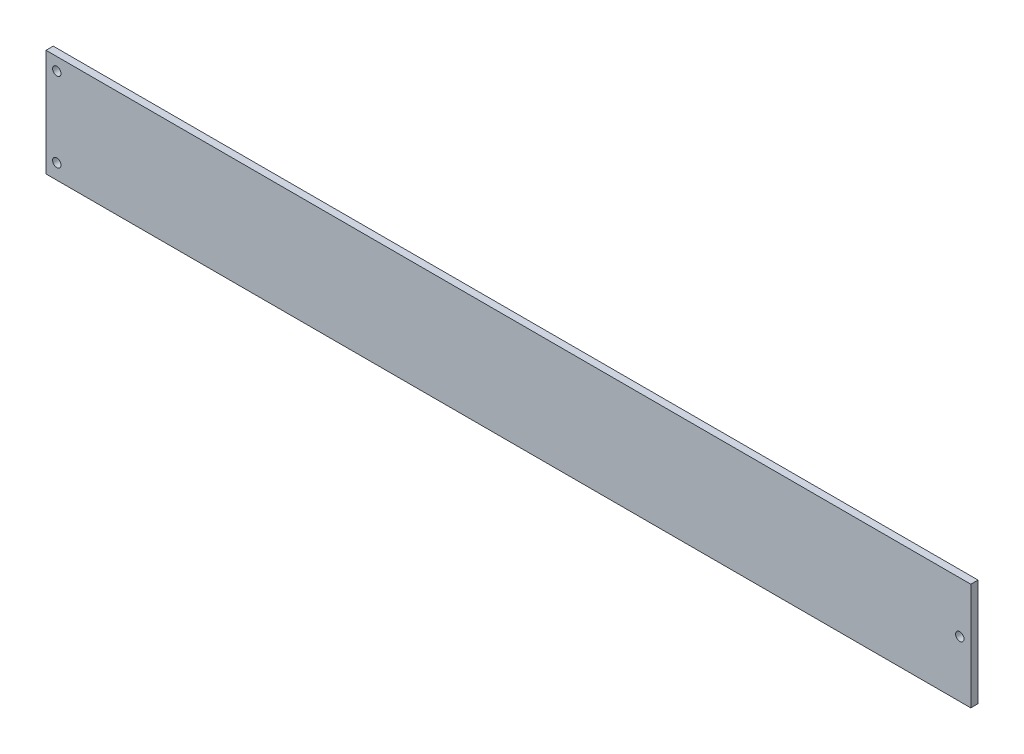
ISO-10303-21;
HEADER;
FILE_DESCRIPTION(('STEP AP214'),'2;1');
FILE_NAME('part.step','',(''),(''),'','','');
FILE_SCHEMA(('AUTOMOTIVE_DESIGN { 1 0 10303 214 1 1 1 1 }'));
ENDSEC;
DATA;
#1=APPLICATION_CONTEXT('core data for automotive mechanical design processes');
#2=APPLICATION_PROTOCOL_DEFINITION('international standard','automotive_design',2000,#1);
#3=PRODUCT_CONTEXT('',#1,'mechanical');
#4=PRODUCT('Part','Part','',(#3));
#5=PRODUCT_RELATED_PRODUCT_CATEGORY('part','',(#4));
#6=PRODUCT_DEFINITION_FORMATION('','',#4);
#7=PRODUCT_DEFINITION_CONTEXT('part definition',#1,'design');
#8=PRODUCT_DEFINITION('design','',#6,#7);
#9=PRODUCT_DEFINITION_SHAPE('','',#8);
#10=(LENGTH_UNIT() NAMED_UNIT(*) SI_UNIT(.MILLI.,.METRE.));
#11=(NAMED_UNIT(*) PLANE_ANGLE_UNIT() SI_UNIT($,.RADIAN.));
#12=(NAMED_UNIT(*) SI_UNIT($,.STERADIAN.) SOLID_ANGLE_UNIT());
#13=UNCERTAINTY_MEASURE_WITH_UNIT(LENGTH_MEASURE(1.E-05),#10,'distance_accuracy_value','');
#14=(GEOMETRIC_REPRESENTATION_CONTEXT(3) GLOBAL_UNCERTAINTY_ASSIGNED_CONTEXT((#13)) GLOBAL_UNIT_ASSIGNED_CONTEXT((#10,
#11,#12)) REPRESENTATION_CONTEXT('',''));
#15=CARTESIAN_POINT('',(0.,0.,0.));
#16=DIRECTION('',(0.,0.,1.));
#17=DIRECTION('',(1.,0.,0.));
#18=AXIS2_PLACEMENT_3D('',#15,#16,#17);
#19=CARTESIAN_POINT('',(192.5,-22.3,3.));
#20=DIRECTION('',(-1.,0.,0.));
#21=DIRECTION('',(0.,0.,1.));
#22=AXIS2_PLACEMENT_3D('',#19,#20,#21);
#23=PLANE('',#22);
#24=DIRECTION('',(0.,1.,0.));
#25=VECTOR('',#24,1.);
#26=CARTESIAN_POINT('',(192.5,-22.3,0.));
#27=LINE('',#26,#25);
#28=CARTESIAN_POINT('',(192.5,-22.3,0.));
#29=VERTEX_POINT('',#28);
#30=CARTESIAN_POINT('',(192.5,22.3,0.));
#31=VERTEX_POINT('',#30);
#32=EDGE_CURVE('E108',#29,#31,#27,.T.);
#33=ORIENTED_EDGE('',*,*,#32,.T.);
#34=DIRECTION('',(0.,0.,-1.));
#35=VECTOR('',#34,1.);
#36=CARTESIAN_POINT('',(192.5,22.3,3.));
#37=LINE('',#36,#35);
#38=CARTESIAN_POINT('',(192.5,22.3,3.));
#39=VERTEX_POINT('',#38);
#40=EDGE_CURVE('E11',#39,#31,#37,.T.);
#41=ORIENTED_EDGE('',*,*,#40,.F.);
#42=DIRECTION('',(0.,1.,0.));
#43=VECTOR('',#42,1.);
#44=CARTESIAN_POINT('',(192.5,-22.3,3.));
#45=LINE('',#44,#43);
#46=CARTESIAN_POINT('',(192.5,-22.3,3.));
#47=VERTEX_POINT('',#46);
#48=EDGE_CURVE('E93',#47,#39,#45,.T.);
#49=ORIENTED_EDGE('',*,*,#48,.F.);
#50=DIRECTION('',(0.,0.,-1.));
#51=VECTOR('',#50,1.);
#52=CARTESIAN_POINT('',(192.5,-22.3,3.));
#53=LINE('',#52,#51);
#54=EDGE_CURVE('E104',#47,#29,#53,.T.);
#55=ORIENTED_EDGE('',*,*,#54,.T.);
#56=EDGE_LOOP('',(#33,#41,#49,#55));
#57=FACE_BOUND('',#56,.T.);
#58=ADVANCED_FACE('F39',(#57),#23,.F.);
#59=CARTESIAN_POINT('',(-192.5,22.3,3.));
#60=DIRECTION('',(0.,-1.,0.));
#61=DIRECTION('',(0.,0.,-1.));
#62=AXIS2_PLACEMENT_3D('',#59,#60,#61);
#63=PLANE('',#62);
#64=DIRECTION('',(-1.,0.,0.));
#65=VECTOR('',#64,1.);
#66=CARTESIAN_POINT('',(-192.5,22.3,0.));
#67=LINE('',#66,#65);
#68=CARTESIAN_POINT('',(-192.5,22.3,0.));
#69=VERTEX_POINT('',#68);
#70=EDGE_CURVE('E98',#31,#69,#67,.T.);
#71=ORIENTED_EDGE('',*,*,#70,.T.);
#72=DIRECTION('',(0.,0.,-1.));
#73=VECTOR('',#72,1.);
#74=CARTESIAN_POINT('',(-192.5,22.3,3.));
#75=LINE('',#74,#73);
#76=CARTESIAN_POINT('',(-192.5,22.3,3.));
#77=VERTEX_POINT('',#76);
#78=EDGE_CURVE('E48',#77,#69,#75,.T.);
#79=ORIENTED_EDGE('',*,*,#78,.F.);
#80=DIRECTION('',(-1.,0.,0.));
#81=VECTOR('',#80,1.);
#82=CARTESIAN_POINT('',(-192.5,22.3,3.));
#83=LINE('',#82,#81);
#84=EDGE_CURVE('E88',#39,#77,#83,.T.);
#85=ORIENTED_EDGE('',*,*,#84,.F.);
#86=ORIENTED_EDGE('',*,*,#40,.T.);
#87=EDGE_LOOP('',(#71,#79,#85,#86));
#88=FACE_BOUND('',#87,.T.);
#89=ADVANCED_FACE('F97',(#88),#63,.F.);
#90=CARTESIAN_POINT('',(-192.5,-22.3,3.));
#91=DIRECTION('',(1.,0.,0.));
#92=DIRECTION('',(0.,0.,-1.));
#93=AXIS2_PLACEMENT_3D('',#90,#91,#92);
#94=PLANE('',#93);
#95=DIRECTION('',(0.,-1.,0.));
#96=VECTOR('',#95,1.);
#97=CARTESIAN_POINT('',(-192.5,-22.3,0.));
#98=LINE('',#97,#96);
#99=CARTESIAN_POINT('',(-192.5,-22.3,0.));
#100=VERTEX_POINT('',#99);
#101=EDGE_CURVE('E75',#69,#100,#98,.T.);
#102=ORIENTED_EDGE('',*,*,#101,.T.);
#103=DIRECTION('',(0.,0.,-1.));
#104=VECTOR('',#103,1.);
#105=CARTESIAN_POINT('',(-192.5,-22.3,3.));
#106=LINE('',#105,#104);
#107=CARTESIAN_POINT('',(-192.5,-22.3,3.));
#108=VERTEX_POINT('',#107);
#109=EDGE_CURVE('E99',#108,#100,#106,.T.);
#110=ORIENTED_EDGE('',*,*,#109,.F.);
#111=DIRECTION('',(0.,-1.,0.));
#112=VECTOR('',#111,1.);
#113=CARTESIAN_POINT('',(-192.5,-22.3,3.));
#114=LINE('',#113,#112);
#115=EDGE_CURVE('E91',#77,#108,#114,.T.);
#116=ORIENTED_EDGE('',*,*,#115,.F.);
#117=ORIENTED_EDGE('',*,*,#78,.T.);
#118=EDGE_LOOP('',(#102,#110,#116,#117));
#119=FACE_BOUND('',#118,.T.);
#120=ADVANCED_FACE('F101',(#119),#94,.F.);
#121=CARTESIAN_POINT('',(-192.5,-22.3,3.));
#122=DIRECTION('',(0.,1.,0.));
#123=DIRECTION('',(0.,0.,1.));
#124=AXIS2_PLACEMENT_3D('',#121,#122,#123);
#125=PLANE('',#124);
#126=DIRECTION('',(1.,0.,0.));
#127=VECTOR('',#126,1.);
#128=CARTESIAN_POINT('',(-192.5,-22.3,0.));
#129=LINE('',#128,#127);
#130=EDGE_CURVE('E81',#100,#29,#129,.T.);
#131=ORIENTED_EDGE('',*,*,#130,.T.);
#132=ORIENTED_EDGE('',*,*,#54,.F.);
#133=DIRECTION('',(1.,0.,0.));
#134=VECTOR('',#133,1.);
#135=CARTESIAN_POINT('',(-192.5,-22.3,3.));
#136=LINE('',#135,#134);
#137=EDGE_CURVE('E58',#108,#47,#136,.T.);
#138=ORIENTED_EDGE('',*,*,#137,.F.);
#139=ORIENTED_EDGE('',*,*,#109,.T.);
#140=EDGE_LOOP('',(#131,#132,#138,#139));
#141=FACE_BOUND('',#140,.T.);
#142=ADVANCED_FACE('F144',(#141),#125,.F.);
#143=CARTESIAN_POINT('',(0.,0.,3.));
#144=DIRECTION('',(0.,0.,-1.));
#145=DIRECTION('',(-1.,0.,0.));
#146=AXIS2_PLACEMENT_3D('',#143,#144,#145);
#147=PLANE('',#146);
#148=CARTESIAN_POINT('',(-188.00660482012,17.030275,3.));
#149=DIRECTION('',(0.,0.,1.));
#150=DIRECTION('',(1.,0.,0.));
#151=AXIS2_PLACEMENT_3D('',#148,#149,#150);
#152=CIRCLE('',#151,1.74999999999998);
#153=CARTESIAN_POINT('',(-186.25660482012,17.030275,3.));
#154=VERTEX_POINT('',#153);
#155=EDGE_CURVE('E124',#154,#154,#152,.T.);
#156=ORIENTED_EDGE('',*,*,#155,.F.);
#157=EDGE_LOOP('',(#156));
#158=FACE_BOUND('',#157,.T.);
#159=CARTESIAN_POINT('',(-188.00660482012,-15.989725,3.));
#160=DIRECTION('',(0.,0.,1.));
#161=DIRECTION('',(1.,0.,0.));
#162=AXIS2_PLACEMENT_3D('',#159,#160,#161);
#163=CIRCLE('',#162,1.74999999999998);
#164=CARTESIAN_POINT('',(-186.25660482012,-15.989725,3.));
#165=VERTEX_POINT('',#164);
#166=EDGE_CURVE('E203',#165,#165,#163,.T.);
#167=ORIENTED_EDGE('',*,*,#166,.F.);
#168=EDGE_LOOP('',(#167));
#169=FACE_BOUND('',#168,.T.);
#170=CARTESIAN_POINT('',(187.91339517988,1.155275,3.));
#171=DIRECTION('',(0.,0.,1.));
#172=DIRECTION('',(1.,0.,0.));
#173=AXIS2_PLACEMENT_3D('',#170,#171,#172);
#174=CIRCLE('',#173,1.75000000000001);
#175=CARTESIAN_POINT('',(189.66339517988,1.155275,3.));
#176=VERTEX_POINT('',#175);
#177=EDGE_CURVE('E205',#176,#176,#174,.T.);
#178=ORIENTED_EDGE('',*,*,#177,.F.);
#179=EDGE_LOOP('',(#178));
#180=FACE_BOUND('',#179,.T.);
#181=ORIENTED_EDGE('',*,*,#48,.T.);
#182=ORIENTED_EDGE('',*,*,#84,.T.);
#183=ORIENTED_EDGE('',*,*,#115,.T.);
#184=ORIENTED_EDGE('',*,*,#137,.T.);
#185=EDGE_LOOP('',(#181,#182,#183,#184));
#186=FACE_BOUND('',#185,.T.);
#187=ADVANCED_FACE('F89',(#158,#169,#180,#186),#147,.F.);
#188=CARTESIAN_POINT('',(0.,0.,0.));
#189=DIRECTION('',(0.,0.,-1.));
#190=DIRECTION('',(-1.,0.,0.));
#191=AXIS2_PLACEMENT_3D('',#188,#189,#190);
#192=PLANE('',#191);
#193=CARTESIAN_POINT('',(-188.00660482012,17.030275,0.));
#194=DIRECTION('',(0.,0.,-1.));
#195=DIRECTION('',(-1.,0.,0.));
#196=AXIS2_PLACEMENT_3D('',#193,#194,#195);
#197=CIRCLE('',#196,1.74999999999998);
#198=CARTESIAN_POINT('',(-189.75660482012,17.030275,0.));
#199=VERTEX_POINT('',#198);
#200=EDGE_CURVE('E42',#199,#199,#197,.T.);
#201=ORIENTED_EDGE('',*,*,#200,.F.);
#202=EDGE_LOOP('',(#201));
#203=FACE_BOUND('',#202,.T.);
#204=CARTESIAN_POINT('',(-188.00660482012,-15.989725,0.));
#205=DIRECTION('',(0.,0.,-1.));
#206=DIRECTION('',(-1.,0.,0.));
#207=AXIS2_PLACEMENT_3D('',#204,#205,#206);
#208=CIRCLE('',#207,1.74999999999998);
#209=CARTESIAN_POINT('',(-189.75660482012,-15.989725,0.));
#210=VERTEX_POINT('',#209);
#211=EDGE_CURVE('E123',#210,#210,#208,.T.);
#212=ORIENTED_EDGE('',*,*,#211,.F.);
#213=EDGE_LOOP('',(#212));
#214=FACE_BOUND('',#213,.T.);
#215=CARTESIAN_POINT('',(187.91339517988,1.155275,0.));
#216=DIRECTION('',(0.,0.,-1.));
#217=DIRECTION('',(-1.,0.,0.));
#218=AXIS2_PLACEMENT_3D('',#215,#216,#217);
#219=CIRCLE('',#218,1.75000000000001);
#220=CARTESIAN_POINT('',(186.16339517988,1.155275,0.));
#221=VERTEX_POINT('',#220);
#222=EDGE_CURVE('E120',#221,#221,#219,.T.);
#223=ORIENTED_EDGE('',*,*,#222,.F.);
#224=EDGE_LOOP('',(#223));
#225=FACE_BOUND('',#224,.T.);
#226=ORIENTED_EDGE('',*,*,#32,.F.);
#227=ORIENTED_EDGE('',*,*,#130,.F.);
#228=ORIENTED_EDGE('',*,*,#101,.F.);
#229=ORIENTED_EDGE('',*,*,#70,.F.);
#230=EDGE_LOOP('',(#226,#227,#228,#229));
#231=FACE_BOUND('',#230,.T.);
#232=ADVANCED_FACE('F134',(#203,#214,#225,#231),#192,.T.);
#233=CARTESIAN_POINT('',(187.91339517988,1.155275,-7.));
#234=DIRECTION('',(0.,0.,1.));
#235=DIRECTION('',(1.,0.,0.));
#236=AXIS2_PLACEMENT_3D('',#233,#234,#235);
#237=CYLINDRICAL_SURFACE('',#236,1.75000000000001);
#238=ORIENTED_EDGE('',*,*,#222,.T.);
#239=EDGE_LOOP('',(#238));
#240=FACE_BOUND('',#239,.T.);
#241=ORIENTED_EDGE('',*,*,#177,.T.);
#242=EDGE_LOOP('',(#241));
#243=FACE_BOUND('',#242,.T.);
#244=ADVANCED_FACE('F137',(#240,#243),#237,.F.);
#245=CARTESIAN_POINT('',(-188.00660482012,-15.989725,-7.));
#246=DIRECTION('',(0.,0.,1.));
#247=DIRECTION('',(1.,0.,0.));
#248=AXIS2_PLACEMENT_3D('',#245,#246,#247);
#249=CYLINDRICAL_SURFACE('',#248,1.74999999999998);
#250=ORIENTED_EDGE('',*,*,#211,.T.);
#251=EDGE_LOOP('',(#250));
#252=FACE_BOUND('',#251,.T.);
#253=ORIENTED_EDGE('',*,*,#166,.T.);
#254=EDGE_LOOP('',(#253));
#255=FACE_BOUND('',#254,.T.);
#256=ADVANCED_FACE('F179',(#252,#255),#249,.F.);
#257=CARTESIAN_POINT('',(-188.00660482012,17.030275,-7.));
#258=DIRECTION('',(0.,0.,1.));
#259=DIRECTION('',(1.,0.,0.));
#260=AXIS2_PLACEMENT_3D('',#257,#258,#259);
#261=CYLINDRICAL_SURFACE('',#260,1.74999999999998);
#262=ORIENTED_EDGE('',*,*,#200,.T.);
#263=EDGE_LOOP('',(#262));
#264=FACE_BOUND('',#263,.T.);
#265=ORIENTED_EDGE('',*,*,#155,.T.);
#266=EDGE_LOOP('',(#265));
#267=FACE_BOUND('',#266,.T.);
#268=ADVANCED_FACE('F131',(#264,#267),#261,.F.);
#269=CLOSED_SHELL('',(#58,#89,#120,#142,#187,#232,#244,#256,#268));
#270=MANIFOLD_SOLID_BREP('B2',#269);
#271=ADVANCED_BREP_SHAPE_REPRESENTATION('',(#18,#270),#14);
#272=SHAPE_DEFINITION_REPRESENTATION(#9,#271);
ENDSEC;
END-ISO-10303-21;
